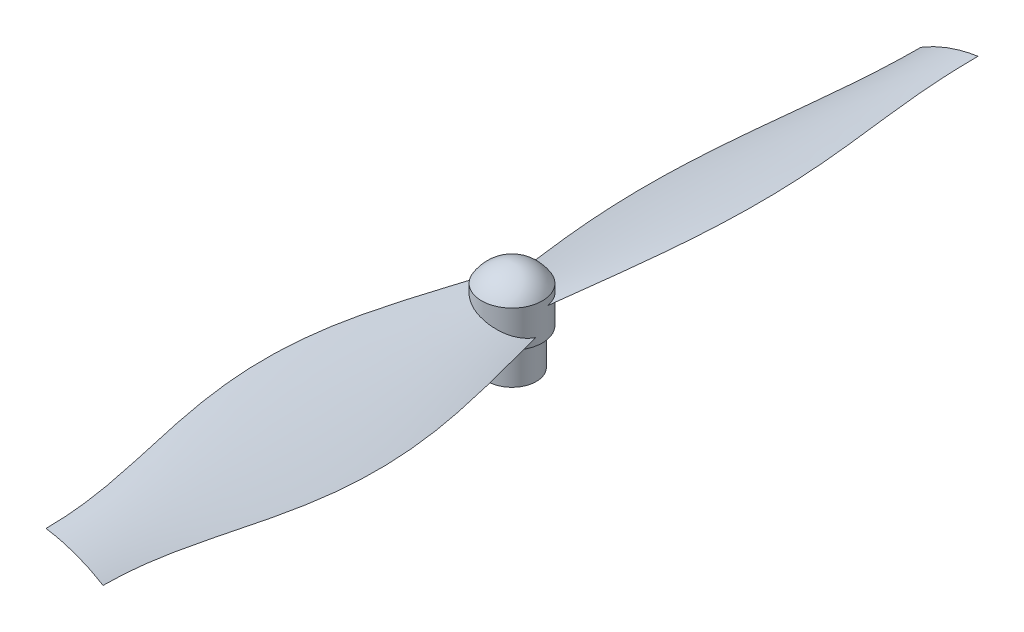
ISO-10303-21;
HEADER;
FILE_DESCRIPTION(('STEP AP214'),'2;1');
FILE_NAME('part.step','',(''),(''),'','','');
FILE_SCHEMA(('AUTOMOTIVE_DESIGN { 1 0 10303 214 1 1 1 1 }'));
ENDSEC;
DATA;
#1=APPLICATION_CONTEXT('core data for automotive mechanical design processes');
#2=APPLICATION_PROTOCOL_DEFINITION('international standard','automotive_design',2000,#1);
#3=PRODUCT_CONTEXT('',#1,'mechanical');
#4=PRODUCT('Part','Part','',(#3));
#5=PRODUCT_RELATED_PRODUCT_CATEGORY('part','',(#4));
#6=PRODUCT_DEFINITION_FORMATION('','',#4);
#7=PRODUCT_DEFINITION_CONTEXT('part definition',#1,'design');
#8=PRODUCT_DEFINITION('design','',#6,#7);
#9=PRODUCT_DEFINITION_SHAPE('','',#8);
#10=(LENGTH_UNIT() NAMED_UNIT(*) SI_UNIT(.MILLI.,.METRE.));
#11=(NAMED_UNIT(*) PLANE_ANGLE_UNIT() SI_UNIT($,.RADIAN.));
#12=(NAMED_UNIT(*) SI_UNIT($,.STERADIAN.) SOLID_ANGLE_UNIT());
#13=UNCERTAINTY_MEASURE_WITH_UNIT(LENGTH_MEASURE(1.E-05),#10,'distance_accuracy_value','');
#14=(GEOMETRIC_REPRESENTATION_CONTEXT(3) GLOBAL_UNCERTAINTY_ASSIGNED_CONTEXT((#13)) GLOBAL_UNIT_ASSIGNED_CONTEXT((#10,
#11,#12)) REPRESENTATION_CONTEXT('',''));
#15=CARTESIAN_POINT('',(0.,0.,0.));
#16=DIRECTION('',(0.,0.,1.));
#17=DIRECTION('',(1.,0.,0.));
#18=AXIS2_PLACEMENT_3D('',#15,#16,#17);
#19=CARTESIAN_POINT('',(-4.69846310392953,7.28989928337164,0.));
#20=CARTESIAN_POINT('',(-4.69846310392953,7.28989928337164,-0.679869268479038));
#21=CARTESIAN_POINT('',(-14.0317929824901,3.89284502098817,-38.1938255156309));
#22=CARTESIAN_POINT('',(-4.69846310392954,7.28989928337164,-54.6154602527929));
#23=CARTESIAN_POINT('',(-4.69846310392954,7.28989928337164,-72.));
#24=CARTESIAN_POINT('',(-1.82850177394058,9.05116134838688,0.));
#25=CARTESIAN_POINT('',(-1.82850177394058,9.05116134838688,-0.679869268479038));
#26=CARTESIAN_POINT('',(-4.90797499953852,7.94005458037023,-38.1938255156309));
#27=CARTESIAN_POINT('',(-1.82850177394058,9.05116134838688,-54.6154602527929));
#28=CARTESIAN_POINT('',(-1.82850177394058,9.05116134838688,-72.));
#29=CARTESIAN_POINT('',(1.36782774232243,10.2145301512131,0.));
#30=CARTESIAN_POINT('',(1.36782774232243,10.2145301512131,-0.679869268479038));
#31=CARTESIAN_POINT('',(4.4410467580453,11.3428202196379,-38.1938255156309));
#32=CARTESIAN_POINT('',(1.36782774232243,10.2145301512131,-54.6154602527929));
#33=CARTESIAN_POINT('',(1.36782774232243,10.2145301512131,-72.));
#34=CARTESIAN_POINT('',(4.69846310392953,10.7101007166284,0.));
#35=CARTESIAN_POINT('',(4.69846310392953,10.7101007166284,-0.679869268479038));
#36=CARTESIAN_POINT('',(14.03179298249,14.1071549790118,-38.1938255156309));
#37=CARTESIAN_POINT('',(4.69846310392954,10.7101007166284,-54.6154602527929));
#38=CARTESIAN_POINT('',(4.69846310392954,10.7101007166284,-72.));
#39=B_SPLINE_SURFACE_WITH_KNOTS('',3,3,((#19,#20,#21,#22,#23),(#24,#25,#26,#27,#28),(#29,#30,
#31,#32,#33),(#34,#35,#36,#37,#38)),.UNSPECIFIED.,.F.,.F.,.F.,(4,4),(4,1,4),(0.,1.),(0.,
0.279461520340345,1.),.UNSPECIFIED.);
#40=CARTESIAN_POINT('',(-4.69846310392953,7.28989928337164,0.));
#41=CARTESIAN_POINT('',(-1.82850177394058,9.05116134838688,0.));
#42=CARTESIAN_POINT('',(1.36782774232243,10.2145301512131,0.));
#43=CARTESIAN_POINT('',(4.69846310392953,10.7101007166284,0.));
#44=B_SPLINE_CURVE_WITH_KNOTS('',3,(#40,#41,#42,#43),.UNSPECIFIED.,.F.,.F.,(4,4),(0.,1.),.UNSPECIFIED.);
#45=CARTESIAN_POINT('',(-4.69846310392953,7.28989928337164,0.));
#46=VERTEX_POINT('',#45);
#47=CARTESIAN_POINT('',(4.69846310392953,10.7101007166284,0.));
#48=VERTEX_POINT('',#47);
#49=EDGE_CURVE('E12',#46,#48,#44,.T.);
#50=CARTESIAN_POINT('',(4.69846310392953,10.7101007166284,0.));
#51=CARTESIAN_POINT('',(4.69846310392953,10.7101007166284,-0.679869268479038));
#52=CARTESIAN_POINT('',(14.03179298249,14.1071549790118,-38.1938255156309));
#53=CARTESIAN_POINT('',(4.69846310392954,10.7101007166284,-54.6154602527929));
#54=CARTESIAN_POINT('',(4.69846310392954,10.7101007166284,-72.));
#55=B_SPLINE_CURVE_WITH_KNOTS('',3,(#50,#51,#52,#53,#54),.UNSPECIFIED.,.F.,.F.,(4,1,4),(0.,
0.279461520340345,1.),.UNSPECIFIED.);
#56=CARTESIAN_POINT('',(4.69846310392954,10.7101007166284,-72.));
#57=VERTEX_POINT('',#56);
#58=EDGE_CURVE('E63',#48,#57,#55,.T.);
#59=CARTESIAN_POINT('',(-4.69846310392954,7.28989928337164,-72.));
#60=CARTESIAN_POINT('',(-1.82850177394058,9.05116134838688,-72.));
#61=CARTESIAN_POINT('',(1.36782774232243,10.2145301512131,-72.));
#62=CARTESIAN_POINT('',(4.69846310392954,10.7101007166284,-72.));
#63=B_SPLINE_CURVE_WITH_KNOTS('',3,(#59,#60,#61,#62),.UNSPECIFIED.,.F.,.F.,(4,4),(0.,1.),.UNSPECIFIED.);
#64=CARTESIAN_POINT('',(-4.69846310392954,7.28989928337164,-72.));
#65=VERTEX_POINT('',#64);
#66=EDGE_CURVE('E71',#57,#65,#63,.F.);
#67=CARTESIAN_POINT('',(-4.69846310392953,7.28989928337164,0.));
#68=CARTESIAN_POINT('',(-4.69846310392953,7.28989928337164,-0.679869268479038));
#69=CARTESIAN_POINT('',(-14.0317929824901,3.89284502098817,-38.1938255156309));
#70=CARTESIAN_POINT('',(-4.69846310392954,7.28989928337164,-54.6154602527929));
#71=CARTESIAN_POINT('',(-4.69846310392954,7.28989928337164,-72.));
#72=B_SPLINE_CURVE_WITH_KNOTS('',3,(#67,#68,#69,#70,#71),.UNSPECIFIED.,.F.,.F.,(4,1,4),(0.,
0.279461520340345,1.),.UNSPECIFIED.);
#73=EDGE_CURVE('E55',#65,#46,#72,.F.);
#74=ORIENTED_EDGE('',*,*,#49,.T.);
#75=ORIENTED_EDGE('',*,*,#58,.T.);
#76=ORIENTED_EDGE('',*,*,#66,.T.);
#77=ORIENTED_EDGE('',*,*,#73,.T.);
#78=EDGE_LOOP('',(#74,#75,#76,#77));
#79=FACE_BOUND('',#78,.T.);
#80=ADVANCED_FACE('F52',(#79),#39,.T.);
#81=OPEN_SHELL('',(#80));
#82=SHELL_BASED_SURFACE_MODEL('B2',(#81));
#83=CARTESIAN_POINT('',(4.69846310392955,7.28989928337168,0.));
#84=CARTESIAN_POINT('',(4.69846310392955,7.28989928337168,0.679869268479038));
#85=CARTESIAN_POINT('',(14.03179298249,3.89284502098813,38.1938255156309));
#86=CARTESIAN_POINT('',(4.69846310392954,7.28989928337164,54.6154602527929));
#87=CARTESIAN_POINT('',(4.69846310392954,7.28989928337164,72.));
#88=CARTESIAN_POINT('',(1.82850177394059,9.05116134838689,0.));
#89=CARTESIAN_POINT('',(1.82850177394059,9.05116134838689,0.679869268479038));
#90=CARTESIAN_POINT('',(4.90797499953849,7.94005458037018,38.1938255156309));
#91=CARTESIAN_POINT('',(1.82850177394058,9.05116134838688,54.6154602527929));
#92=CARTESIAN_POINT('',(1.82850177394058,9.05116134838688,72.));
#93=CARTESIAN_POINT('',(-1.36782774232244,10.2145301512131,0.));
#94=CARTESIAN_POINT('',(-1.36782774232244,10.2145301512131,0.679869268479038));
#95=CARTESIAN_POINT('',(-4.44104675804528,11.3428202196378,38.1938255156309));
#96=CARTESIAN_POINT('',(-1.36782774232243,10.2145301512131,54.6154602527929));
#97=CARTESIAN_POINT('',(-1.36782774232243,10.2145301512131,72.));
#98=CARTESIAN_POINT('',(-4.69846310392955,10.7101007166283,0.));
#99=CARTESIAN_POINT('',(-4.69846310392955,10.7101007166283,0.679869268479038));
#100=CARTESIAN_POINT('',(-14.03179298249,14.1071549790118,38.1938255156309));
#101=CARTESIAN_POINT('',(-4.69846310392954,10.7101007166284,54.6154602527929));
#102=CARTESIAN_POINT('',(-4.69846310392954,10.7101007166284,72.));
#103=B_SPLINE_SURFACE_WITH_KNOTS('',3,3,((#83,#84,#85,#86,#87),(#88,#89,#90,#91,#92),(#93,#94,
#95,#96,#97),(#98,#99,#100,#101,#102)),.UNSPECIFIED.,.F.,.F.,.F.,(4,4),(4,1,4),(0.,1.),(0.,
0.279461520340345,1.),.UNSPECIFIED.);
#104=CARTESIAN_POINT('',(4.69846310392955,7.28989928337168,0.));
#105=CARTESIAN_POINT('',(1.82850177394059,9.05116134838689,0.));
#106=CARTESIAN_POINT('',(-1.36782774232244,10.2145301512131,0.));
#107=CARTESIAN_POINT('',(-4.69846310392955,10.7101007166283,0.));
#108=B_SPLINE_CURVE_WITH_KNOTS('',3,(#104,#105,#106,#107),.UNSPECIFIED.,.F.,.F.,(4,4),(0.,1.),.UNSPECIFIED.);
#109=CARTESIAN_POINT('',(4.69846310392955,7.28989928337168,0.));
#110=VERTEX_POINT('',#109);
#111=CARTESIAN_POINT('',(-4.69846310392955,10.7101007166283,0.));
#112=VERTEX_POINT('',#111);
#113=EDGE_CURVE('E50',#110,#112,#108,.T.);
#114=CARTESIAN_POINT('',(-4.69846310392955,10.7101007166283,0.));
#115=CARTESIAN_POINT('',(-4.69846310392955,10.7101007166283,0.679869268479038));
#116=CARTESIAN_POINT('',(-14.03179298249,14.1071549790118,38.1938255156309));
#117=CARTESIAN_POINT('',(-4.69846310392954,10.7101007166284,54.6154602527929));
#118=CARTESIAN_POINT('',(-4.69846310392954,10.7101007166284,72.));
#119=B_SPLINE_CURVE_WITH_KNOTS('',3,(#114,#115,#116,#117,#118),.UNSPECIFIED.,.F.,.F.,(4,1,4),
(0.,0.279461520340345,1.),.UNSPECIFIED.);
#120=CARTESIAN_POINT('',(-4.69846310392954,10.7101007166284,72.));
#121=VERTEX_POINT('',#120);
#122=EDGE_CURVE('E143',#112,#121,#119,.T.);
#123=CARTESIAN_POINT('',(4.69846310392954,7.28989928337164,72.));
#124=CARTESIAN_POINT('',(1.82850177394058,9.05116134838688,72.));
#125=CARTESIAN_POINT('',(-1.36782774232243,10.2145301512131,72.));
#126=CARTESIAN_POINT('',(-4.69846310392954,10.7101007166284,72.));
#127=B_SPLINE_CURVE_WITH_KNOTS('',3,(#123,#124,#125,#126),.UNSPECIFIED.,.F.,.F.,(4,4),(0.,1.),.UNSPECIFIED.);
#128=CARTESIAN_POINT('',(4.69846310392954,7.28989928337164,72.));
#129=VERTEX_POINT('',#128);
#130=EDGE_CURVE('E151',#121,#129,#127,.F.);
#131=CARTESIAN_POINT('',(4.69846310392955,7.28989928337168,0.));
#132=CARTESIAN_POINT('',(4.69846310392955,7.28989928337168,0.679869268479038));
#133=CARTESIAN_POINT('',(14.03179298249,3.89284502098813,38.1938255156309));
#134=CARTESIAN_POINT('',(4.69846310392954,7.28989928337164,54.6154602527929));
#135=CARTESIAN_POINT('',(4.69846310392954,7.28989928337164,72.));
#136=B_SPLINE_CURVE_WITH_KNOTS('',3,(#131,#132,#133,#134,#135),.UNSPECIFIED.,.F.,.F.,(4,1,4),
(0.,0.279461520340345,1.),.UNSPECIFIED.);
#137=EDGE_CURVE('E135',#129,#110,#136,.F.);
#138=ORIENTED_EDGE('',*,*,#113,.T.);
#139=ORIENTED_EDGE('',*,*,#122,.T.);
#140=ORIENTED_EDGE('',*,*,#130,.T.);
#141=ORIENTED_EDGE('',*,*,#137,.T.);
#142=EDGE_LOOP('',(#138,#139,#140,#141));
#143=FACE_BOUND('',#142,.T.);
#144=ADVANCED_FACE('F132',(#143),#103,.T.);
#145=OPEN_SHELL('',(#144));
#146=SHELL_BASED_SURFACE_MODEL('B6',(#145));
#147=CARTESIAN_POINT('',(0.,0.,0.));
#148=DIRECTION('',(0.,-1.,0.));
#149=DIRECTION('',(0.,0.,-1.));
#150=AXIS2_PLACEMENT_3D('',#147,#148,#149);
#151=PLANE('',#150);
#152=DIRECTION('',(1.,0.,0.));
#153=VECTOR('',#152,1.);
#154=CARTESIAN_POINT('',(-1.44337567297407,0.,-2.5));
#155=LINE('',#154,#153);
#156=CARTESIAN_POINT('',(-1.44337567297407,0.,-2.5));
#157=VERTEX_POINT('',#156);
#158=CARTESIAN_POINT('',(1.44337567297406,0.,-2.5));
#159=VERTEX_POINT('',#158);
#160=EDGE_CURVE('E218',#157,#159,#155,.T.);
#161=ORIENTED_EDGE('',*,*,#160,.F.);
#162=DIRECTION('',(0.5,0.,-0.866025403784439));
#163=VECTOR('',#162,1.);
#164=CARTESIAN_POINT('',(-2.88675134594813,0.,0.));
#165=LINE('',#164,#163);
#166=CARTESIAN_POINT('',(-2.88675134594813,0.,0.));
#167=VERTEX_POINT('',#166);
#168=EDGE_CURVE('E280',#167,#157,#165,.T.);
#169=ORIENTED_EDGE('',*,*,#168,.F.);
#170=DIRECTION('',(-0.5,0.,-0.866025403784439));
#171=VECTOR('',#170,1.);
#172=CARTESIAN_POINT('',(-1.44337567297406,0.,2.5));
#173=LINE('',#172,#171);
#174=CARTESIAN_POINT('',(-1.44337567297406,0.,2.5));
#175=VERTEX_POINT('',#174);
#176=EDGE_CURVE('E284',#175,#167,#173,.T.);
#177=ORIENTED_EDGE('',*,*,#176,.F.);
#178=DIRECTION('',(-1.,0.,0.));
#179=VECTOR('',#178,1.);
#180=CARTESIAN_POINT('',(1.44337567297406,0.,2.5));
#181=LINE('',#180,#179);
#182=CARTESIAN_POINT('',(1.44337567297406,0.,2.5));
#183=VERTEX_POINT('',#182);
#184=EDGE_CURVE('E307',#183,#175,#181,.T.);
#185=ORIENTED_EDGE('',*,*,#184,.F.);
#186=DIRECTION('',(-0.5,0.,0.866025403784439));
#187=VECTOR('',#186,1.);
#188=CARTESIAN_POINT('',(2.88675134594813,0.,0.));
#189=LINE('',#188,#187);
#190=CARTESIAN_POINT('',(2.88675134594813,0.,0.));
#191=VERTEX_POINT('',#190);
#192=EDGE_CURVE('E303',#191,#183,#189,.T.);
#193=ORIENTED_EDGE('',*,*,#192,.F.);
#194=DIRECTION('',(0.5,0.,0.866025403784438));
#195=VECTOR('',#194,1.);
#196=CARTESIAN_POINT('',(1.44337567297406,0.,-2.5));
#197=LINE('',#196,#195);
#198=EDGE_CURVE('E300',#159,#191,#197,.T.);
#199=ORIENTED_EDGE('',*,*,#198,.F.);
#200=EDGE_LOOP('',(#161,#169,#177,#185,#193,#199));
#201=FACE_BOUND('',#200,.T.);
#202=CARTESIAN_POINT('',(0.,0.,0.));
#203=DIRECTION('',(0.,-1.,0.));
#204=DIRECTION('',(0.,0.,-1.));
#205=AXIS2_PLACEMENT_3D('',#202,#203,#204);
#206=CIRCLE('',#205,4.);
#207=CARTESIAN_POINT('',(0.,0.,-4.));
#208=VERTEX_POINT('',#207);
#209=EDGE_CURVE('E317',#208,#208,#206,.T.);
#210=ORIENTED_EDGE('',*,*,#209,.T.);
#211=EDGE_LOOP('',(#210));
#212=FACE_BOUND('',#211,.T.);
#213=ADVANCED_FACE('F203',(#201,#212),#151,.T.);
#214=CARTESIAN_POINT('',(0.,9.00326916134687,0.19803850319188));
#215=DIRECTION('',(-1.,0.,0.));
#216=DIRECTION('',(0.,0.,-1.));
#217=AXIS2_PLACEMENT_3D('',#214,#215,#216);
#218=CIRCLE('',#217,6.);
#219=TRIMMED_CURVE('',#218,(PARAMETER_VALUE(-1.53778391366149)),
(PARAMETER_VALUE(1.53778391366149)),.T.,.PARAMETER.);
#220=CARTESIAN_POINT('',(0.,9.00326916134687,0.));
#221=DIRECTION('',(0.,-1.,0.));
#222=AXIS1_PLACEMENT('',#220,#221);
#223=SURFACE_OF_REVOLUTION('',#219,#222);
#224=CARTESIAN_POINT('',(0.,15.,0.));
#225=VERTEX_POINT('',#224);
#226=VERTEX_LOOP('',#225);
#227=FACE_BOUND('',#226,.T.);
#228=CARTESIAN_POINT('',(0.,12.,0.));
#229=DIRECTION('',(0.,-1.,0.));
#230=DIRECTION('',(0.,0.,-1.));
#231=AXIS2_PLACEMENT_3D('',#228,#229,#230);
#232=CIRCLE('',#231,5.);
#233=CARTESIAN_POINT('',(0.,12.,-5.));
#234=VERTEX_POINT('',#233);
#235=EDGE_CURVE('E130',#234,#234,#232,.T.);
#236=ORIENTED_EDGE('',*,*,#235,.F.);
#237=EDGE_LOOP('',(#236));
#238=FACE_BOUND('',#237,.T.);
#239=ADVANCED_FACE('F344',(#227,#238),#223,.T.);
#240=CARTESIAN_POINT('',(0.,0.,0.));
#241=DIRECTION('',(0.,-1.,0.));
#242=DIRECTION('',(0.,0.,-1.));
#243=AXIS2_PLACEMENT_3D('',#240,#241,#242);
#244=CYLINDRICAL_SURFACE('',#243,5.);
#245=ORIENTED_EDGE('',*,*,#235,.T.);
#246=EDGE_LOOP('',(#245));
#247=FACE_BOUND('',#246,.T.);
#248=CARTESIAN_POINT('',(0.,6.,0.));
#249=DIRECTION('',(0.,-1.,0.));
#250=DIRECTION('',(0.,0.,-1.));
#251=AXIS2_PLACEMENT_3D('',#248,#249,#250);
#252=CIRCLE('',#251,5.);
#253=CARTESIAN_POINT('',(0.,6.,-5.));
#254=VERTEX_POINT('',#253);
#255=EDGE_CURVE('E211',#254,#254,#252,.T.);
#256=ORIENTED_EDGE('',*,*,#255,.F.);
#257=EDGE_LOOP('',(#256));
#258=FACE_BOUND('',#257,.T.);
#259=ADVANCED_FACE('F342',(#247,#258),#244,.T.);
#260=CARTESIAN_POINT('',(4.,6.,0.));
#261=DIRECTION('',(0.,-1.,0.));
#262=DIRECTION('',(0.,0.,-1.));
#263=AXIS2_PLACEMENT_3D('',#260,#261,#262);
#264=PLANE('',#263);
#265=ORIENTED_EDGE('',*,*,#255,.T.);
#266=EDGE_LOOP('',(#265));
#267=FACE_BOUND('',#266,.T.);
#268=CARTESIAN_POINT('',(0.,6.,0.));
#269=DIRECTION('',(0.,-1.,0.));
#270=DIRECTION('',(0.,0.,-1.));
#271=AXIS2_PLACEMENT_3D('',#268,#269,#270);
#272=CIRCLE('',#271,4.);
#273=CARTESIAN_POINT('',(0.,6.,-4.));
#274=VERTEX_POINT('',#273);
#275=EDGE_CURVE('E332',#274,#274,#272,.T.);
#276=ORIENTED_EDGE('',*,*,#275,.F.);
#277=EDGE_LOOP('',(#276));
#278=FACE_BOUND('',#277,.T.);
#279=ADVANCED_FACE('F339',(#267,#278),#264,.T.);
#280=CARTESIAN_POINT('',(0.,0.,0.));
#281=DIRECTION('',(0.,-1.,0.));
#282=DIRECTION('',(0.,0.,-1.));
#283=AXIS2_PLACEMENT_3D('',#280,#281,#282);
#284=CYLINDRICAL_SURFACE('',#283,4.);
#285=ORIENTED_EDGE('',*,*,#275,.T.);
#286=EDGE_LOOP('',(#285));
#287=FACE_BOUND('',#286,.T.);
#288=ORIENTED_EDGE('',*,*,#209,.F.);
#289=EDGE_LOOP('',(#288));
#290=FACE_BOUND('',#289,.T.);
#291=ADVANCED_FACE('F351',(#287,#290),#284,.T.);
#292=CARTESIAN_POINT('',(-1.44337567297407,7.,-2.5));
#293=DIRECTION('',(0.,0.,-1.));
#294=DIRECTION('',(-1.,0.,0.));
#295=AXIS2_PLACEMENT_3D('',#292,#293,#294);
#296=PLANE('',#295);
#297=ORIENTED_EDGE('',*,*,#160,.T.);
#298=DIRECTION('',(0.,-1.,0.));
#299=VECTOR('',#298,1.);
#300=CARTESIAN_POINT('',(1.44337567297406,7.,-2.5));
#301=LINE('',#300,#299);
#302=CARTESIAN_POINT('',(1.44337567297406,7.,-2.5));
#303=VERTEX_POINT('',#302);
#304=EDGE_CURVE('E254',#303,#159,#301,.T.);
#305=ORIENTED_EDGE('',*,*,#304,.F.);
#306=DIRECTION('',(1.,0.,0.));
#307=VECTOR('',#306,1.);
#308=CARTESIAN_POINT('',(-1.44337567297407,7.,-2.5));
#309=LINE('',#308,#307);
#310=CARTESIAN_POINT('',(-1.44337567297407,7.,-2.5));
#311=VERTEX_POINT('',#310);
#312=EDGE_CURVE('E258',#311,#303,#309,.T.);
#313=ORIENTED_EDGE('',*,*,#312,.F.);
#314=DIRECTION('',(0.,-1.,0.));
#315=VECTOR('',#314,1.);
#316=CARTESIAN_POINT('',(-1.44337567297407,7.,-2.5));
#317=LINE('',#316,#315);
#318=EDGE_CURVE('E314',#311,#157,#317,.T.);
#319=ORIENTED_EDGE('',*,*,#318,.T.);
#320=EDGE_LOOP('',(#297,#305,#313,#319));
#321=FACE_BOUND('',#320,.T.);
#322=ADVANCED_FACE('F256',(#321),#296,.F.);
#323=CARTESIAN_POINT('',(-2.88675134594813,7.,0.));
#324=DIRECTION('',(-0.866025403784439,0.,-0.5));
#325=DIRECTION('',(-0.5,0.,0.866025403784439));
#326=AXIS2_PLACEMENT_3D('',#323,#324,#325);
#327=PLANE('',#326);
#328=ORIENTED_EDGE('',*,*,#168,.T.);
#329=ORIENTED_EDGE('',*,*,#318,.F.);
#330=DIRECTION('',(0.5,0.,-0.866025403784439));
#331=VECTOR('',#330,1.);
#332=CARTESIAN_POINT('',(-2.88675134594813,7.,0.));
#333=LINE('',#332,#331);
#334=CARTESIAN_POINT('',(-2.88675134594813,7.,0.));
#335=VERTEX_POINT('',#334);
#336=EDGE_CURVE('E265',#335,#311,#333,.T.);
#337=ORIENTED_EDGE('',*,*,#336,.F.);
#338=DIRECTION('',(0.,-1.,0.));
#339=VECTOR('',#338,1.);
#340=CARTESIAN_POINT('',(-2.88675134594813,7.,0.));
#341=LINE('',#340,#339);
#342=EDGE_CURVE('E318',#335,#167,#341,.T.);
#343=ORIENTED_EDGE('',*,*,#342,.T.);
#344=EDGE_LOOP('',(#328,#329,#337,#343));
#345=FACE_BOUND('',#344,.T.);
#346=ADVANCED_FACE('F367',(#345),#327,.F.);
#347=CARTESIAN_POINT('',(-1.44337567297406,7.,2.5));
#348=DIRECTION('',(-0.866025403784438,0.,0.5));
#349=DIRECTION('',(0.5,0.,0.866025403784439));
#350=AXIS2_PLACEMENT_3D('',#347,#348,#349);
#351=PLANE('',#350);
#352=ORIENTED_EDGE('',*,*,#176,.T.);
#353=ORIENTED_EDGE('',*,*,#342,.F.);
#354=DIRECTION('',(-0.5,0.,-0.866025403784439));
#355=VECTOR('',#354,1.);
#356=CARTESIAN_POINT('',(-1.44337567297406,7.,2.5));
#357=LINE('',#356,#355);
#358=CARTESIAN_POINT('',(-1.44337567297406,7.,2.5));
#359=VERTEX_POINT('',#358);
#360=EDGE_CURVE('E293',#359,#335,#357,.T.);
#361=ORIENTED_EDGE('',*,*,#360,.F.);
#362=DIRECTION('',(0.,-1.,0.));
#363=VECTOR('',#362,1.);
#364=CARTESIAN_POINT('',(-1.44337567297406,7.,2.5));
#365=LINE('',#364,#363);
#366=EDGE_CURVE('E321',#359,#175,#365,.T.);
#367=ORIENTED_EDGE('',*,*,#366,.T.);
#368=EDGE_LOOP('',(#352,#353,#361,#367));
#369=FACE_BOUND('',#368,.T.);
#370=ADVANCED_FACE('F379',(#369),#351,.F.);
#371=CARTESIAN_POINT('',(1.44337567297406,7.,2.5));
#372=DIRECTION('',(0.,0.,1.));
#373=DIRECTION('',(1.,0.,0.));
#374=AXIS2_PLACEMENT_3D('',#371,#372,#373);
#375=PLANE('',#374);
#376=ORIENTED_EDGE('',*,*,#184,.T.);
#377=ORIENTED_EDGE('',*,*,#366,.F.);
#378=DIRECTION('',(-1.,0.,0.));
#379=VECTOR('',#378,1.);
#380=CARTESIAN_POINT('',(1.44337567297406,7.,2.5));
#381=LINE('',#380,#379);
#382=CARTESIAN_POINT('',(1.44337567297406,7.,2.5));
#383=VERTEX_POINT('',#382);
#384=EDGE_CURVE('E289',#383,#359,#381,.T.);
#385=ORIENTED_EDGE('',*,*,#384,.F.);
#386=DIRECTION('',(0.,-1.,0.));
#387=VECTOR('',#386,1.);
#388=CARTESIAN_POINT('',(1.44337567297406,7.,2.5));
#389=LINE('',#388,#387);
#390=EDGE_CURVE('E324',#383,#183,#389,.T.);
#391=ORIENTED_EDGE('',*,*,#390,.T.);
#392=EDGE_LOOP('',(#376,#377,#385,#391));
#393=FACE_BOUND('',#392,.T.);
#394=ADVANCED_FACE('F375',(#393),#375,.F.);
#395=CARTESIAN_POINT('',(2.88675134594813,7.,0.));
#396=DIRECTION('',(0.866025403784439,0.,0.5));
#397=DIRECTION('',(0.5,0.,-0.866025403784439));
#398=AXIS2_PLACEMENT_3D('',#395,#396,#397);
#399=PLANE('',#398);
#400=ORIENTED_EDGE('',*,*,#192,.T.);
#401=ORIENTED_EDGE('',*,*,#390,.F.);
#402=DIRECTION('',(-0.5,0.,0.866025403784439));
#403=VECTOR('',#402,1.);
#404=CARTESIAN_POINT('',(2.88675134594813,7.,0.));
#405=LINE('',#404,#403);
#406=CARTESIAN_POINT('',(2.88675134594813,7.,0.));
#407=VERTEX_POINT('',#406);
#408=EDGE_CURVE('E274',#407,#383,#405,.T.);
#409=ORIENTED_EDGE('',*,*,#408,.F.);
#410=DIRECTION('',(0.,-1.,0.));
#411=VECTOR('',#410,1.);
#412=CARTESIAN_POINT('',(2.88675134594813,7.,0.));
#413=LINE('',#412,#411);
#414=EDGE_CURVE('E264',#407,#191,#413,.T.);
#415=ORIENTED_EDGE('',*,*,#414,.T.);
#416=EDGE_LOOP('',(#400,#401,#409,#415));
#417=FACE_BOUND('',#416,.T.);
#418=ADVANCED_FACE('F372',(#417),#399,.F.);
#419=CARTESIAN_POINT('',(1.44337567297406,7.,-2.5));
#420=DIRECTION('',(0.866025403784438,0.,-0.5));
#421=DIRECTION('',(-0.5,0.,-0.866025403784438));
#422=AXIS2_PLACEMENT_3D('',#419,#420,#421);
#423=PLANE('',#422);
#424=ORIENTED_EDGE('',*,*,#198,.T.);
#425=ORIENTED_EDGE('',*,*,#414,.F.);
#426=DIRECTION('',(0.5,0.,0.866025403784438));
#427=VECTOR('',#426,1.);
#428=CARTESIAN_POINT('',(1.44337567297406,7.,-2.5));
#429=LINE('',#428,#427);
#430=EDGE_CURVE('E268',#303,#407,#429,.T.);
#431=ORIENTED_EDGE('',*,*,#430,.F.);
#432=ORIENTED_EDGE('',*,*,#304,.T.);
#433=EDGE_LOOP('',(#424,#425,#431,#432));
#434=FACE_BOUND('',#433,.T.);
#435=ADVANCED_FACE('F269',(#434),#423,.F.);
#436=CARTESIAN_POINT('',(0.,7.,0.));
#437=DIRECTION('',(0.,-1.,0.));
#438=DIRECTION('',(0.,0.,-1.));
#439=AXIS2_PLACEMENT_3D('',#436,#437,#438);
#440=PLANE('',#439);
#441=ORIENTED_EDGE('',*,*,#312,.T.);
#442=ORIENTED_EDGE('',*,*,#430,.T.);
#443=ORIENTED_EDGE('',*,*,#408,.T.);
#444=ORIENTED_EDGE('',*,*,#384,.T.);
#445=ORIENTED_EDGE('',*,*,#360,.T.);
#446=ORIENTED_EDGE('',*,*,#336,.T.);
#447=EDGE_LOOP('',(#441,#442,#443,#444,#445,#446));
#448=FACE_BOUND('',#447,.T.);
#449=ADVANCED_FACE('F276',(#448),#440,.T.);
#450=CLOSED_SHELL('',(#213,#239,#259,#279,#291,#322,#346,#370,#394,#418,#435,#449));
#451=MANIFOLD_SOLID_BREP('B44',#450);
#452=ADVANCED_BREP_SHAPE_REPRESENTATION('',(#18,#451),#14);
#453=MANIFOLD_SURFACE_SHAPE_REPRESENTATION('',(#18,#82,#146),#14);
#454=SHAPE_REPRESENTATION('',(#18),#14);
#455=SHAPE_DEFINITION_REPRESENTATION(#9,#454);
#456=SHAPE_REPRESENTATION_RELATIONSHIP('','',#454,#452);
#457=SHAPE_REPRESENTATION_RELATIONSHIP('','',#454,#453);
ENDSEC;
END-ISO-10303-21;
